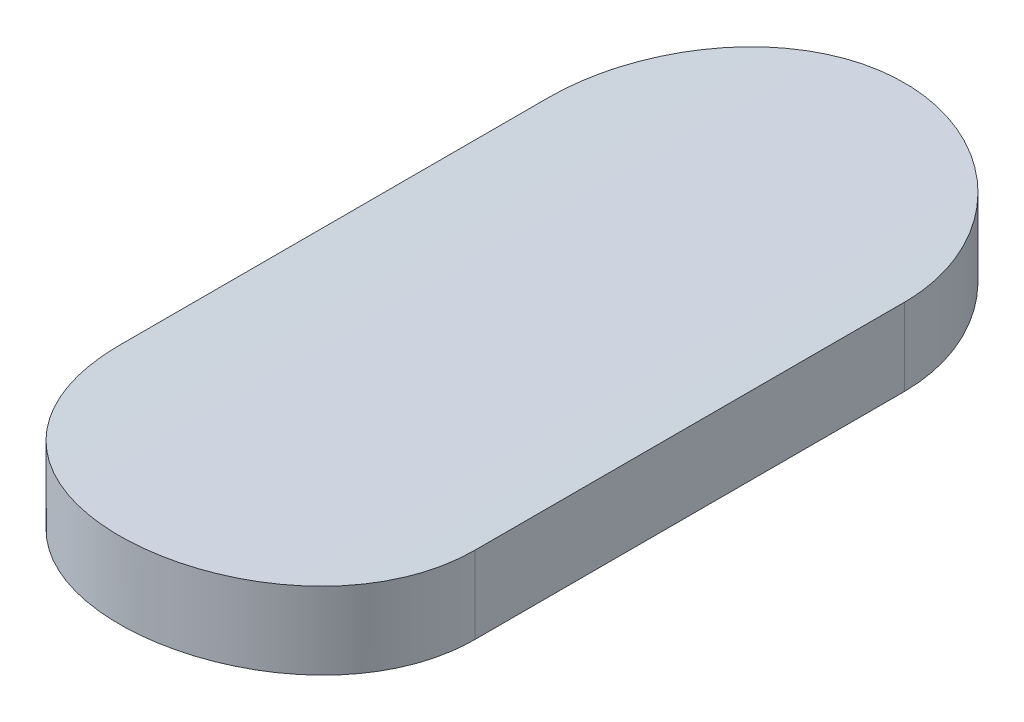
ISO-10303-21;
HEADER;
FILE_DESCRIPTION(('STEP AP214'),'2;1');
FILE_NAME('part.step','',(''),(''),'','','');
FILE_SCHEMA(('AUTOMOTIVE_DESIGN { 1 0 10303 214 1 1 1 1 }'));
ENDSEC;
DATA;
#1=APPLICATION_CONTEXT('core data for automotive mechanical design processes');
#2=APPLICATION_PROTOCOL_DEFINITION('international standard','automotive_design',2000,#1);
#3=PRODUCT_CONTEXT('',#1,'mechanical');
#4=PRODUCT('Part','Part','',(#3));
#5=PRODUCT_RELATED_PRODUCT_CATEGORY('part','',(#4));
#6=PRODUCT_DEFINITION_FORMATION('','',#4);
#7=PRODUCT_DEFINITION_CONTEXT('part definition',#1,'design');
#8=PRODUCT_DEFINITION('design','',#6,#7);
#9=PRODUCT_DEFINITION_SHAPE('','',#8);
#10=(LENGTH_UNIT() NAMED_UNIT(*) SI_UNIT(.MILLI.,.METRE.));
#11=(NAMED_UNIT(*) PLANE_ANGLE_UNIT() SI_UNIT($,.RADIAN.));
#12=(NAMED_UNIT(*) SI_UNIT($,.STERADIAN.) SOLID_ANGLE_UNIT());
#13=UNCERTAINTY_MEASURE_WITH_UNIT(LENGTH_MEASURE(1.E-05),#10,'distance_accuracy_value','');
#14=(GEOMETRIC_REPRESENTATION_CONTEXT(3) GLOBAL_UNCERTAINTY_ASSIGNED_CONTEXT((#13)) GLOBAL_UNIT_ASSIGNED_CONTEXT((#10,
#11,#12)) REPRESENTATION_CONTEXT('',''));
#15=CARTESIAN_POINT('',(0.,0.,0.));
#16=DIRECTION('',(0.,0.,1.));
#17=DIRECTION('',(1.,0.,0.));
#18=AXIS2_PLACEMENT_3D('',#15,#16,#17);
#19=CARTESIAN_POINT('',(-75.4181941684126,-39.6644186635389,0.584683614855501));
#20=DIRECTION('',(0.,0.,1.));
#21=DIRECTION('',(1.,0.,0.));
#22=AXIS2_PLACEMENT_3D('',#19,#20,#21);
#23=CYLINDRICAL_SURFACE('',#22,2.00000000000003);
#24=DIRECTION('',(0.,0.,1.));
#25=VECTOR('',#24,1.);
#26=CARTESIAN_POINT('',(-75.6966157953255,-37.6838931278117,2.19965606593906));
#27=LINE('',#26,#25);
#28=CARTESIAN_POINT('',(-75.6966157953255,-37.6838931278117,1.52614089397217));
#29=VERTEX_POINT('',#28);
#30=CARTESIAN_POINT('',(-75.6966157953255,-37.6838931278117,2.19965606593906));
#31=VERTEX_POINT('',#30);
#32=EDGE_CURVE('E72',#29,#31,#27,.T.);
#33=ORIENTED_EDGE('',*,*,#32,.T.);
#34=CARTESIAN_POINT('',(-75.1397725414866,-37.6838931278136,2.19965606593906));
#35=CARTESIAN_POINT('',(-75.1397588796207,-37.6839002866824,2.21523901509955));
#36=CARTESIAN_POINT('',(-75.1410799225853,-37.6837094111274,2.2308162677905));
#37=CARTESIAN_POINT('',(-75.1462885944889,-37.6829849067766,2.26151012045991));
#38=CARTESIAN_POINT('',(-75.1501733182881,-37.6824516659645,2.27662722161693));
#39=CARTESIAN_POINT('',(-75.1604085498956,-37.6810953115339,2.30599330416704));
#40=CARTESIAN_POINT('',(-75.1667598272963,-37.680272107451,2.3202420130051));
#41=CARTESIAN_POINT('',(-75.1817396397894,-37.6784311594776,2.34747067805798));
#42=CARTESIAN_POINT('',(-75.1903679668946,-37.6774134333571,2.36045075000262));
#43=CARTESIAN_POINT('',(-75.2097197306448,-37.6752898729645,2.38486162852108));
#44=CARTESIAN_POINT('',(-75.2204553998979,-37.674183547727,2.39628269569918));
#45=CARTESIAN_POINT('',(-75.2436949315732,-37.6720115826156,2.41717105052035));
#46=CARTESIAN_POINT('',(-75.2561994511821,-37.6709459580511,2.4266376087687));
#47=CARTESIAN_POINT('',(-75.2826865812824,-37.6689701638389,2.44338334394178));
#48=CARTESIAN_POINT('',(-75.2966756305398,-37.6680607202235,2.45065241840268));
#49=CARTESIAN_POINT('',(-75.3256802616351,-37.6665069471062,2.46272636573327));
#50=CARTESIAN_POINT('',(-75.3406946165842,-37.6658623070035,2.46753412723626));
#51=CARTESIAN_POINT('',(-75.3661906867543,-37.6650687404205,2.47337812352523));
#52=CARTESIAN_POINT('',(-75.3765094630458,-37.6648261366692,2.47513790629961));
#53=CARTESIAN_POINT('',(-75.3972820582866,-37.6645010155627,2.47748792325612));
#54=CARTESIAN_POINT('',(-75.4077358788044,-37.6644185000685,2.47807814384187));
#55=CARTESIAN_POINT('',(-75.4337519183809,-37.6644189067167,2.47807702198039));
#56=CARTESIAN_POINT('',(-75.449319558229,-37.6646021145814,2.47676922250956));
#57=CARTESIAN_POINT('',(-75.4800209223927,-37.6653153707964,2.47157324468367));
#58=CARTESIAN_POINT('',(-75.4951541758995,-37.6658457816674,2.46768236923307));
#59=CARTESIAN_POINT('',(-75.524537296991,-37.6671937576896,2.45743806412376));
#60=CARTESIAN_POINT('',(-75.538787810993,-37.6680111097223,2.45108646174869));
#61=CARTESIAN_POINT('',(-75.5660183827944,-37.669842397042,2.43610502344549));
#62=CARTESIAN_POINT('',(-75.5789986259308,-37.6708563035864,2.42747552055255));
#63=CARTESIAN_POINT('',(-75.6034100675533,-37.6729753872155,2.40812130142741));
#64=CARTESIAN_POINT('',(-75.6148314615177,-37.6740810774153,2.39738427439823));
#65=CARTESIAN_POINT('',(-75.6357169845139,-37.6762550992279,2.37414528489901));
#66=CARTESIAN_POINT('',(-75.6451809299362,-37.6773234273283,2.36164315704677));
#67=CARTESIAN_POINT('',(-75.6619217538811,-37.6793069555814,2.33516253507374));
#68=CARTESIAN_POINT('',(-75.6691886877188,-37.6802214513813,2.32117770377686));
#69=CARTESIAN_POINT('',(-75.6812636393248,-37.6817861316722,2.29217326491073));
#70=CARTESIAN_POINT('',(-75.6860730762994,-37.6824364686703,2.27715426027746));
#71=CARTESIAN_POINT('',(-75.691918595569,-37.6832370693846,2.25164765166141));
#72=CARTESIAN_POINT('',(-75.6936785663991,-37.6834818214154,2.24132309798971));
#73=CARTESIAN_POINT('',(-75.6960272293276,-37.6838103779396,2.22055259136692));
#74=CARTESIAN_POINT('',(-75.6966174212662,-37.6838943885239,2.21010681116456));
#75=CARTESIAN_POINT('',(-75.6966157953255,-37.6838931278118,2.19965606593906));
#76=B_SPLINE_CURVE_WITH_KNOTS('',3,(#34,#35,#36,#37,#38,#39,#40,#41,#42,#43,#44,#45,#46,#47,#48,
#49,#50,#51,#52,#53,#54,#55,#56,#57,#58,#59,#60,#61,#62,#63,#64,#65,#66,#67,#68,#69,#70,#71,#72,
#73,#74,#75),.UNSPECIFIED.,.F.,.F.,(4,2,2,2,2,2,2,2,2,2,2,2,2,2,2,2,2,2,2,2,4),(0.,
0.0466833192223902,0.0933138279618857,0.139958897647033,0.186599708214386,0.233519721309609,
0.28045721275786,0.327607317912799,0.374701959415366,0.406050734595081,0.4373998742077,
0.484034849393314,0.530718594814421,0.57736774011771,0.62401006896399,0.670933427046093,
0.717861184561915,0.764998283538021,0.812108129951557,0.84347406083282,0.874799749581128),.UNSPECIFIED.);
#77=CARTESIAN_POINT('',(-75.1397725414866,-37.6838931278136,2.19965606593906));
#78=VERTEX_POINT('',#77);
#79=EDGE_CURVE('E21',#78,#31,#76,.T.);
#80=ORIENTED_EDGE('',*,*,#79,.F.);
#81=DIRECTION('',(0.,0.,1.));
#82=VECTOR('',#81,1.);
#83=CARTESIAN_POINT('',(-75.1397725414866,-37.6838931278136,1.52614089397217));
#84=LINE('',#83,#82);
#85=CARTESIAN_POINT('',(-75.1397725414866,-37.6838931278136,1.52614089397217));
#86=VERTEX_POINT('',#85);
#87=EDGE_CURVE('E59',#78,#86,#84,.F.);
#88=ORIENTED_EDGE('',*,*,#87,.T.);
#89=CARTESIAN_POINT('',(-75.6966157953255,-37.6838931278118,1.52614089397217));
#90=CARTESIAN_POINT('',(-75.6966294551295,-37.6839002867788,1.5105579025762));
#91=CARTESIAN_POINT('',(-75.6953084060336,-37.6837094101403,1.49498060774955));
#92=CARTESIAN_POINT('',(-75.6900997223513,-37.682984903865,1.46428675744977));
#93=CARTESIAN_POINT('',(-75.6862150067653,-37.682451664063,1.44916969840531));
#94=CARTESIAN_POINT('',(-75.6759798910917,-37.681095325679,1.41980396078943));
#95=CARTESIAN_POINT('',(-75.6696287659323,-37.6802721418662,1.40555553900532));
#96=CARTESIAN_POINT('',(-75.6546490646654,-37.6784312018188,1.37832682417252));
#97=CARTESIAN_POINT('',(-75.6460206019817,-37.6774134552751,1.36534646801139));
#98=CARTESIAN_POINT('',(-75.6266675065483,-37.6752897558642,1.34093397913917));
#99=CARTESIAN_POINT('',(-75.6159304559895,-37.6741833046273,1.32951173265974));
#100=CARTESIAN_POINT('',(-75.5926907558505,-37.6720113462003,1.30862382978101));
#101=CARTESIAN_POINT('',(-75.580187837307,-37.6709458452788,1.29915847198195));
#102=CARTESIAN_POINT('',(-75.553708465243,-37.6689706990596,1.2824180752708));
#103=CARTESIAN_POINT('',(-75.5397261782164,-37.6680617109434,1.27515217939642));
#104=CARTESIAN_POINT('',(-75.5107258272774,-37.6665076298967,1.26307595852311));
#105=CARTESIAN_POINT('',(-75.4957078713967,-37.6658625094904,1.25826537784643));
#106=CARTESIAN_POINT('',(-75.4651646944313,-37.6649123258311,1.25126591825546));
#107=CARTESIAN_POINT('',(-75.4496433779763,-37.6646050922705,1.24906030034949));
#108=CARTESIAN_POINT('',(-75.4184477239863,-37.6643578699444,1.24728143324667));
#109=CARTESIAN_POINT('',(-75.4027733901594,-37.6644178723014,1.247708120417));
#110=CARTESIAN_POINT('',(-75.3718315278119,-37.6648966308364,1.25116854477549));
#111=CARTESIAN_POINT('',(-75.3565619335515,-37.6653128992251,1.25418420374456));
#112=CARTESIAN_POINT('',(-75.3267477544281,-37.6664546352049,1.2627086259478));
#113=CARTESIAN_POINT('',(-75.3122031819229,-37.6671801080642,1.26821743166022));
#114=CARTESIAN_POINT('',(-75.2841962757678,-37.6688630418128,1.28159072517155));
#115=CARTESIAN_POINT('',(-75.2707376908188,-37.66982126401,1.28946296396959));
#116=CARTESIAN_POINT('',(-75.2453263231457,-37.6718626513786,1.30733365677507));
#117=CARTESIAN_POINT('',(-75.233373564732,-37.6729458185666,1.31733214510206));
#118=CARTESIAN_POINT('',(-75.2112075527389,-37.6751268689559,1.33927107507363));
#119=CARTESIAN_POINT('',(-75.2010096555949,-37.676224799518,1.35122703325542));
#120=CARTESIAN_POINT('',(-75.1827599571932,-37.678302991191,1.37669276554794));
#121=CARTESIAN_POINT('',(-75.1747087848961,-37.6792832177701,1.39020299338219));
#122=CARTESIAN_POINT('',(-75.160978686353,-37.6810155063499,1.41841293060074));
#123=CARTESIAN_POINT('',(-75.1553025839182,-37.6817672964648,1.43311403122398));
#124=CARTESIAN_POINT('',(-75.1465149521259,-37.6829517101126,1.4632560169925));
#125=CARTESIAN_POINT('',(-75.1433995707512,-37.6833848129343,1.47869575386592));
#126=CARTESIAN_POINT('',(-75.1403810235822,-37.6838079660354,1.50485861165103));
#127=CARTESIAN_POINT('',(-75.1397671156949,-37.6838956949834,1.51550211962231));
#128=CARTESIAN_POINT('',(-75.1397725414866,-37.6838931278136,1.52614089397217));
#129=B_SPLINE_CURVE_WITH_KNOTS('',3,(#89,#90,#91,#92,#93,#94,#95,#96,#97,#98,#99,#100,#101,#102,
#103,#104,#105,#106,#107,#108,#109,#110,#111,#112,#113,#114,#115,#116,#117,#118,#119,#120,#121,
#122,#123,#124,#125,#126,#127,#128),.UNSPECIFIED.,.F.,.F.,(4,2,2,2,2,2,2,2,2,2,2,2,2,2,2,2,2,2,
2,4),(0.,0.046683445205683,0.0933138279590832,0.139957929441397,0.186599708232392,
0.233524883020567,0.280457212811403,0.327582040016522,0.374701959000845,0.421517417926936,
0.468331745150025,0.514821812645198,0.561312672268412,0.607957698215604,0.65460347711198,
0.701638704811785,0.748687698077968,0.79579247182685,0.842826256899453,0.874737605827836),.UNSPECIFIED.);
#130=EDGE_CURVE('E73',#29,#86,#129,.T.);
#131=ORIENTED_EDGE('',*,*,#130,.F.);
#132=EDGE_LOOP('',(#33,#80,#88,#131));
#133=FACE_BOUND('',#132,.T.);
#134=ADVANCED_FACE('F17',(#133),#23,.T.);
#135=CARTESIAN_POINT('',(-75.6966157953255,-36.7841716842097,2.19965606593906));
#136=DIRECTION('',(1.,0.,0.));
#137=DIRECTION('',(0.,1.,0.));
#138=AXIS2_PLACEMENT_3D('',#135,#136,#137);
#139=PLANE('',#138);
#140=DIRECTION('',(0.,0.,1.));
#141=VECTOR('',#140,1.);
#142=CARTESIAN_POINT('',(-75.6966157953255,-37.8051496142436,0.584683614855501));
#143=LINE('',#142,#141);
#144=CARTESIAN_POINT('',(-75.6966157953255,-37.8051496142436,1.52614089397217));
#145=VERTEX_POINT('',#144);
#146=CARTESIAN_POINT('',(-75.6966157953255,-37.8051496142436,2.19965606593906));
#147=VERTEX_POINT('',#146);
#148=EDGE_CURVE('E80',#145,#147,#143,.T.);
#149=ORIENTED_EDGE('',*,*,#148,.T.);
#150=DIRECTION('',(0.,1.,0.));
#151=VECTOR('',#150,1.);
#152=CARTESIAN_POINT('',(-75.6966157953255,-36.7841716842097,2.19965606593906));
#153=LINE('',#152,#151);
#154=EDGE_CURVE('E67',#31,#147,#153,.F.);
#155=ORIENTED_EDGE('',*,*,#154,.F.);
#156=ORIENTED_EDGE('',*,*,#32,.F.);
#157=DIRECTION('',(0.,1.,0.));
#158=VECTOR('',#157,1.);
#159=CARTESIAN_POINT('',(-75.6966157953255,-36.7841716842097,1.52614089397217));
#160=LINE('',#159,#158);
#161=EDGE_CURVE('E106',#145,#29,#160,.T.);
#162=ORIENTED_EDGE('',*,*,#161,.F.);
#163=EDGE_LOOP('',(#149,#155,#156,#162));
#164=FACE_BOUND('',#163,.T.);
#165=ADVANCED_FACE('F79',(#164),#139,.F.);
#166=CARTESIAN_POINT('',(-75.418194168406,-36.7841716842097,2.19965606593906));
#167=DIRECTION('',(0.,1.,0.));
#168=DIRECTION('',(0.,0.,1.));
#169=AXIS2_PLACEMENT_3D('',#166,#167,#168);
#170=CYLINDRICAL_SURFACE('',#169,0.278421626919453);
#171=DIRECTION('',(0.,-1.,0.));
#172=VECTOR('',#171,1.);
#173=CARTESIAN_POINT('',(-75.1397725414866,-36.7841716842097,2.19965606593906));
#174=LINE('',#173,#172);
#175=CARTESIAN_POINT('',(-75.1397725414866,-37.8051496142456,2.19965606593906));
#176=VERTEX_POINT('',#175);
#177=EDGE_CURVE('E69',#176,#78,#174,.F.);
#178=ORIENTED_EDGE('',*,*,#177,.T.);
#179=ORIENTED_EDGE('',*,*,#79,.T.);
#180=ORIENTED_EDGE('',*,*,#154,.T.);
#181=CARTESIAN_POINT('',(-75.6966157953255,-37.8051496142436,2.19965606593906));
#182=CARTESIAN_POINT('',(-75.6966295038028,-37.8051572393913,2.21522842836192));
#183=CARTESIAN_POINT('',(-75.6953101994287,-37.8049541814077,2.23079486495932));
#184=CARTESIAN_POINT('',(-75.690109018842,-37.8041835505037,2.2614662089742));
#185=CARTESIAN_POINT('',(-75.6862301803886,-37.8036164097132,2.27657164132236));
#186=CARTESIAN_POINT('',(-75.6760114596759,-37.8021740062335,2.30591448750951));
#187=CARTESIAN_POINT('',(-75.6696708650069,-37.8012986543577,2.32015164869756));
#188=CARTESIAN_POINT('',(-75.6547171315147,-37.7993412078685,2.34735955381966));
#189=CARTESIAN_POINT('',(-75.6461041558783,-37.7982591281025,2.36033038860104));
#190=CARTESIAN_POINT('',(-75.6267793473538,-37.7960003153402,2.38473655627343));
#191=CARTESIAN_POINT('',(-75.616053666076,-37.794822989769,2.3961608700702));
#192=CARTESIAN_POINT('',(-75.592833632192,-37.7925113607528,2.41705817533316));
#193=CARTESIAN_POINT('',(-75.5803386241755,-37.7913770734488,2.42653044049636));
#194=CARTESIAN_POINT('',(-75.5538611205533,-37.7892729092734,2.44329500871226));
#195=CARTESIAN_POINT('',(-75.5398713807072,-37.7883038982052,2.45057597595422));
#196=CARTESIAN_POINT('',(-75.5108612947826,-37.7866479076237,2.46267283957954));
#197=CARTESIAN_POINT('',(-75.495842182068,-37.7859605972493,2.46749162947411));
#198=CARTESIAN_POINT('',(-75.4703176254345,-37.7851134497988,2.47335621631247));
#199=CARTESIAN_POINT('',(-75.4599756186793,-37.7848541661652,2.47512417512298));
#200=CARTESIAN_POINT('',(-75.4391552875877,-37.784506685393,2.4774851457269));
#201=CARTESIAN_POINT('',(-75.4286769618496,-37.7844184900149,2.47807814543068));
#202=CARTESIAN_POINT('',(-75.4026472370212,-37.7844189208899,2.47807702165789));
#203=CARTESIAN_POINT('',(-75.3870904786617,-37.7846135507164,2.47677101809327));
#204=CARTESIAN_POINT('',(-75.3564110722337,-37.7853712857245,2.47158251034113));
#205=CARTESIAN_POINT('',(-75.3412888926158,-37.7859347740282,2.4676973271791));
#206=CARTESIAN_POINT('',(-75.311928068605,-37.7873668725892,2.45746902098006));
#207=CARTESIAN_POINT('',(-75.2976887443478,-37.7882352445416,2.4511278172343));
#208=CARTESIAN_POINT('',(-75.2704784810671,-37.7901811147863,2.43617186032075));
#209=CARTESIAN_POINT('',(-75.2575073669559,-37.7912585841494,2.42755742160262));
#210=CARTESIAN_POINT('',(-75.2331009309381,-37.7935119466699,2.40822989293327));
#211=CARTESIAN_POINT('',(-75.2216766416652,-37.7946884587713,2.39750294268109));
#212=CARTESIAN_POINT('',(-75.2007828077585,-37.7970025136342,2.37428373266139));
#213=CARTESIAN_POINT('',(-75.1913134520173,-37.7981400526213,2.36179130250317));
#214=CARTESIAN_POINT('',(-75.1745540920291,-37.8002535759086,2.33532042616169));
#215=CARTESIAN_POINT('',(-75.1672753254846,-37.8012287160713,2.32133479987334));
#216=CARTESIAN_POINT('',(-75.1551776282177,-37.8028978267722,2.29232478758499));
#217=CARTESIAN_POINT('',(-75.1503572558827,-37.8035919620434,2.27730101624074));
#218=CARTESIAN_POINT('',(-75.144491415594,-37.8044475770177,2.25176632009404));
#219=CARTESIAN_POINT('',(-75.1427233918427,-37.8047094639075,2.24141896723059));
#220=CARTESIAN_POINT('',(-75.1403638552584,-37.8050610563511,2.22060132340964));
#221=CARTESIAN_POINT('',(-75.1397708703736,-37.8051509773333,2.21013120282276));
#222=CARTESIAN_POINT('',(-75.1397725414866,-37.8051496142456,2.19965606593906));
#223=B_SPLINE_CURVE_WITH_KNOTS('',3,(#181,#182,#183,#184,#185,#186,#187,#188,#189,#190,#191,
#192,#193,#194,#195,#196,#197,#198,#199,#200,#201,#202,#203,#204,#205,#206,#207,#208,#209,#210,
#211,#212,#213,#214,#215,#216,#217,#218,#219,#220,#221,#222),.UNSPECIFIED.,.F.,.F.,(4,2,2,2,2,2,
2,2,2,2,2,2,2,2,2,2,2,2,2,2,4),(0.,0.0466511443936112,0.093247020651388,0.139856391389549,
0.186462415871439,0.233384759868322,0.280324530968139,0.327503109929281,0.374626117122652,
0.406048286567917,0.437470779327131,0.484073179873424,0.530724061879886,0.577338561226522,
0.623946615908499,0.670871318505151,0.717800553014244,0.76496658388046,0.812104924496497,
0.843542947120782,0.874941560220145),.UNSPECIFIED.);
#224=EDGE_CURVE('E91',#147,#176,#223,.T.);
#225=ORIENTED_EDGE('',*,*,#224,.T.);
#226=EDGE_LOOP('',(#178,#179,#180,#225));
#227=FACE_BOUND('',#226,.T.);
#228=ADVANCED_FACE('F65',(#227),#170,.T.);
#229=CARTESIAN_POINT('',(-75.1397725414866,-36.7841716842097,1.52614089397217));
#230=DIRECTION('',(-1.,0.,0.));
#231=DIRECTION('',(0.,-1.,0.));
#232=AXIS2_PLACEMENT_3D('',#229,#230,#231);
#233=PLANE('',#232);
#234=DIRECTION('',(0.,0.,1.));
#235=VECTOR('',#234,1.);
#236=CARTESIAN_POINT('',(-75.1397725414866,-37.8051496142456,0.584683614855501));
#237=LINE('',#236,#235);
#238=CARTESIAN_POINT('',(-75.1397725414866,-37.8051496142456,1.52614089397217));
#239=VERTEX_POINT('',#238);
#240=EDGE_CURVE('E31',#176,#239,#237,.F.);
#241=ORIENTED_EDGE('',*,*,#240,.T.);
#242=DIRECTION('',(0.,1.,0.));
#243=VECTOR('',#242,1.);
#244=CARTESIAN_POINT('',(-75.1397725414866,-36.7841716842097,1.52614089397217));
#245=LINE('',#244,#243);
#246=EDGE_CURVE('E39',#86,#239,#245,.F.);
#247=ORIENTED_EDGE('',*,*,#246,.F.);
#248=ORIENTED_EDGE('',*,*,#87,.F.);
#249=ORIENTED_EDGE('',*,*,#177,.F.);
#250=EDGE_LOOP('',(#241,#247,#248,#249));
#251=FACE_BOUND('',#250,.T.);
#252=ADVANCED_FACE('F101',(#251),#233,.F.);
#253=CARTESIAN_POINT('',(-75.418194168406,-36.7841716842097,1.52614089397217));
#254=DIRECTION('',(0.,1.,0.));
#255=DIRECTION('',(0.,0.,1.));
#256=AXIS2_PLACEMENT_3D('',#253,#254,#255);
#257=CYLINDRICAL_SURFACE('',#256,0.278421626919453);
#258=ORIENTED_EDGE('',*,*,#246,.T.);
#259=CARTESIAN_POINT('',(-75.1397725414866,-37.8051496142456,1.52614089397217));
#260=CARTESIAN_POINT('',(-75.1397588350659,-37.8051572394955,1.51056849120913));
#261=CARTESIAN_POINT('',(-75.1410781452483,-37.804954180409,1.49500201436461));
#262=CARTESIAN_POINT('',(-75.1462793369872,-37.8041835475463,1.46433067261263));
#263=CARTESIAN_POINT('',(-75.1501581675563,-37.8036164077817,1.44922528048705));
#264=CARTESIAN_POINT('',(-75.1603767740938,-37.8021740211422,1.41988277442128));
#265=CARTESIAN_POINT('',(-75.166717218209,-37.8012986906222,1.40564589743399));
#266=CARTESIAN_POINT('',(-75.1816708416012,-37.7993412524808,1.3784379430849));
#267=CARTESIAN_POINT('',(-75.1902839511942,-37.7982591511998,1.36546682692932));
#268=CARTESIAN_POINT('',(-75.209610081683,-37.7960001914588,1.34105905898462));
#269=CARTESIAN_POINT('',(-75.220337135329,-37.7948227325701,1.32963357228809));
#270=CARTESIAN_POINT('',(-75.24355733616,-37.7925111105833,1.30873671587951));
#271=CARTESIAN_POINT('',(-75.2560507526851,-37.7913769541217,1.29926564472513));
#272=CARTESIAN_POINT('',(-75.2825205313667,-37.7892734773686,1.28250640100051));
#273=CARTESIAN_POINT('',(-75.2965035333387,-37.7883049499183,1.27522860738973));
#274=CARTESIAN_POINT('',(-75.3255093448904,-37.7866486332373,1.26312947793725));
#275=CARTESIAN_POINT('',(-75.3405320404209,-37.7859608132713,1.25830787314721));
#276=CARTESIAN_POINT('',(-75.3710751559233,-37.7849476053348,1.25129160485302));
#277=CARTESIAN_POINT('',(-75.3865911407171,-37.7846196076603,1.24907801723494));
#278=CARTESIAN_POINT('',(-75.417777926248,-37.7843540561494,1.24728185559384));
#279=CARTESIAN_POINT('',(-75.4334487222802,-37.7844164904834,1.24769920185717));
#280=CARTESIAN_POINT('',(-75.4643703881213,-37.7849226954765,1.25113820409133));
#281=CARTESIAN_POINT('',(-75.4796235860829,-37.7853634744948,1.25413942941615));
#282=CARTESIAN_POINT('',(-75.509407354373,-37.7865735031477,1.26262891808112));
#283=CARTESIAN_POINT('',(-75.5239379107623,-37.7873427591156,1.26811722937459));
#284=CARTESIAN_POINT('',(-75.5519262334113,-37.7891284688191,1.28144619761677));
#285=CARTESIAN_POINT('',(-75.5653798133417,-37.7901458303543,1.28929551851728));
#286=CARTESIAN_POINT('',(-75.5907860118106,-37.7923142655683,1.30711702578602));
#287=CARTESIAN_POINT('',(-75.6027385934253,-37.793465342535,1.31708926436081));
#288=CARTESIAN_POINT('',(-75.6249230883978,-37.7957857527397,1.33898601139105));
#289=CARTESIAN_POINT('',(-75.6351376474299,-37.7969551556573,1.35092810236336));
#290=CARTESIAN_POINT('',(-75.6534231928164,-37.7991700170521,1.37636993756546));
#291=CARTESIAN_POINT('',(-75.6614935565659,-37.8002154394806,1.38987013258972));
#292=CARTESIAN_POINT('',(-75.6752647807048,-37.8020645134775,1.41806707736053));
#293=CARTESIAN_POINT('',(-75.6809624931049,-37.8028678434544,1.43276538603883));
#294=CARTESIAN_POINT('',(-75.6897927764177,-37.8041349922365,1.46290735725903));
#295=CARTESIAN_POINT('',(-75.6929291941156,-37.8045993200743,1.47834986501389));
#296=CARTESIAN_POINT('',(-75.6959941379899,-37.805056928479,1.50462972392152));
#297=CARTESIAN_POINT('',(-75.6966214061108,-37.8051524387913,1.51538762730932));
#298=CARTESIAN_POINT('',(-75.6966157953255,-37.8051496142436,1.52614089397217));
#299=B_SPLINE_CURVE_WITH_KNOTS('',3,(#259,#260,#261,#262,#263,#264,#265,#266,#267,#268,#269,
#270,#271,#272,#273,#274,#275,#276,#277,#278,#279,#280,#281,#282,#283,#284,#285,#286,#287,#288,
#289,#290,#291,#292,#293,#294,#295,#296,#297,#298),.UNSPECIFIED.,.F.,.F.,(4,2,2,2,2,2,2,2,2,2,2,
2,2,2,2,2,2,2,2,4),(0.,0.0466512647283328,0.0932470206483178,0.139855432735308,
0.186462415891345,0.233389891773645,0.28032453102654,0.327477905993089,0.374626116637625,
0.421430064459332,0.468232594193231,0.514668421450695,0.561105144072014,0.607714393845471,
0.654324789960879,0.701376291565872,0.748441440513791,0.795568837177584,0.842625322780671,
0.87487934579148),.UNSPECIFIED.);
#300=EDGE_CURVE('E11',#239,#145,#299,.T.);
#301=ORIENTED_EDGE('',*,*,#300,.T.);
#302=ORIENTED_EDGE('',*,*,#161,.T.);
#303=ORIENTED_EDGE('',*,*,#130,.T.);
#304=EDGE_LOOP('',(#258,#301,#302,#303));
#305=FACE_BOUND('',#304,.T.);
#306=ADVANCED_FACE('F97',(#305),#257,.T.);
#307=CARTESIAN_POINT('',(-75.4181941684126,-39.6644186635389,0.584683614855501));
#308=DIRECTION('',(0.,0.,1.));
#309=DIRECTION('',(1.,0.,0.));
#310=AXIS2_PLACEMENT_3D('',#307,#308,#309);
#311=CYLINDRICAL_SURFACE('',#310,1.88000000000003);
#312=ORIENTED_EDGE('',*,*,#240,.F.);
#313=ORIENTED_EDGE('',*,*,#224,.F.);
#314=ORIENTED_EDGE('',*,*,#148,.F.);
#315=ORIENTED_EDGE('',*,*,#300,.F.);
#316=EDGE_LOOP('',(#312,#313,#314,#315));
#317=FACE_BOUND('',#316,.T.);
#318=ADVANCED_FACE('F95',(#317),#311,.F.);
#319=CLOSED_SHELL('',(#134,#165,#228,#252,#306,#318));
#320=MANIFOLD_SOLID_BREP('B1',#319);
#321=ADVANCED_BREP_SHAPE_REPRESENTATION('',(#18,#320),#14);
#322=SHAPE_DEFINITION_REPRESENTATION(#9,#321);
ENDSEC;
END-ISO-10303-21;
